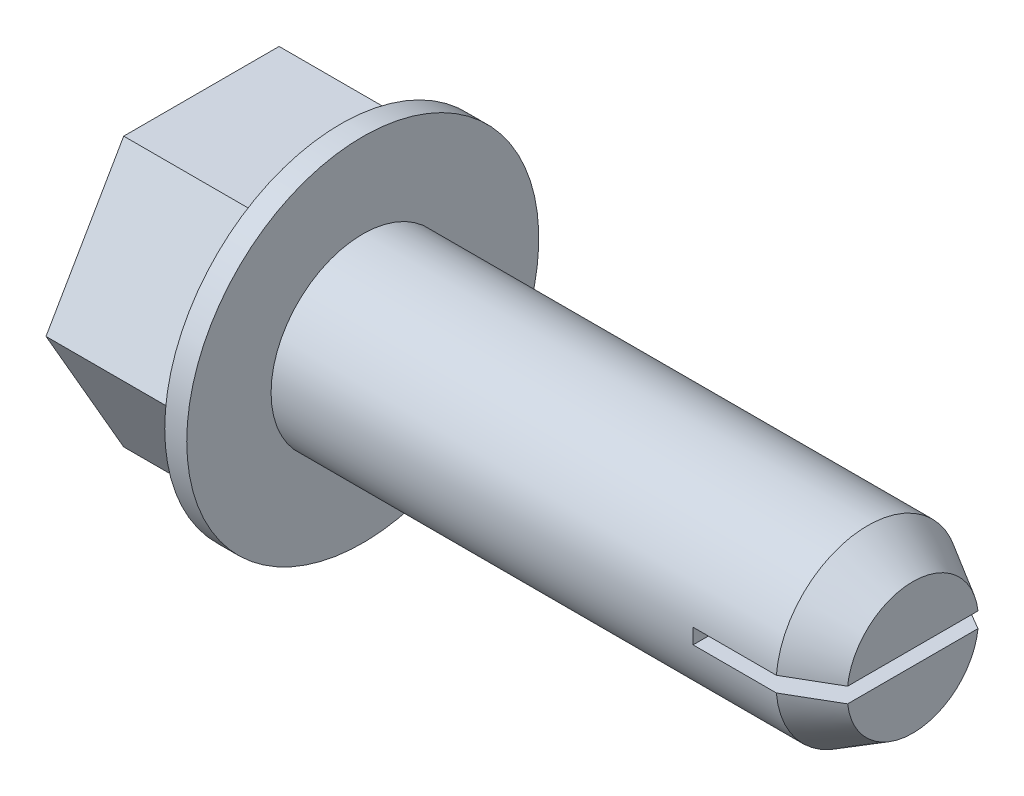
ISO-10303-21;
HEADER;
FILE_DESCRIPTION(('STEP AP214'),'2;1');
FILE_NAME('part.step','',(''),(''),'','','');
FILE_SCHEMA(('AUTOMOTIVE_DESIGN { 1 0 10303 214 1 1 1 1 }'));
ENDSEC;
DATA;
#1=APPLICATION_CONTEXT('core data for automotive mechanical design processes');
#2=APPLICATION_PROTOCOL_DEFINITION('international standard','automotive_design',2000,#1);
#3=PRODUCT_CONTEXT('',#1,'mechanical');
#4=PRODUCT('Part','Part','',(#3));
#5=PRODUCT_RELATED_PRODUCT_CATEGORY('part','',(#4));
#6=PRODUCT_DEFINITION_FORMATION('','',#4);
#7=PRODUCT_DEFINITION_CONTEXT('part definition',#1,'design');
#8=PRODUCT_DEFINITION('design','',#6,#7);
#9=PRODUCT_DEFINITION_SHAPE('','',#8);
#10=(LENGTH_UNIT() NAMED_UNIT(*) SI_UNIT(.MILLI.,.METRE.));
#11=(NAMED_UNIT(*) PLANE_ANGLE_UNIT() SI_UNIT($,.RADIAN.));
#12=(NAMED_UNIT(*) SI_UNIT($,.STERADIAN.) SOLID_ANGLE_UNIT());
#13=UNCERTAINTY_MEASURE_WITH_UNIT(LENGTH_MEASURE(1.E-05),#10,'distance_accuracy_value','');
#14=(GEOMETRIC_REPRESENTATION_CONTEXT(3) GLOBAL_UNCERTAINTY_ASSIGNED_CONTEXT((#13)) GLOBAL_UNIT_ASSIGNED_CONTEXT((#10,
#11,#12)) REPRESENTATION_CONTEXT('',''));
#15=CARTESIAN_POINT('',(0.,0.,0.));
#16=DIRECTION('',(0.,0.,1.));
#17=DIRECTION('',(1.,0.,0.));
#18=AXIS2_PLACEMENT_3D('',#15,#16,#17);
#19=CARTESIAN_POINT('',(-4.6228,3.72872,0.));
#20=DIRECTION('',(1.,0.,0.));
#21=DIRECTION('',(0.,0.,-1.));
#22=AXIS2_PLACEMENT_3D('',#19,#20,#21);
#23=PLANE('',#22);
#24=CARTESIAN_POINT('',(-4.6228,0.,0.));
#25=DIRECTION('',(-1.,0.,0.));
#26=DIRECTION('',(0.,0.,1.));
#27=AXIS2_PLACEMENT_3D('',#24,#25,#26);
#28=CIRCLE('',#27,3.72872);
#29=CARTESIAN_POINT('',(-4.6228,0.,3.72872));
#30=VERTEX_POINT('',#29);
#31=EDGE_CURVE('E21',#30,#30,#28,.T.);
#32=ORIENTED_EDGE('',*,*,#31,.T.);
#33=EDGE_LOOP('',(#32));
#34=FACE_BOUND('',#33,.T.);
#35=ADVANCED_FACE('F18',(#34),#23,.F.);
#36=CARTESIAN_POINT('',(0.,0.,0.));
#37=DIRECTION('',(-1.,0.,0.));
#38=DIRECTION('',(0.,0.,1.));
#39=AXIS2_PLACEMENT_3D('',#36,#37,#38);
#40=CYLINDRICAL_SURFACE('',#39,3.72872);
#41=ORIENTED_EDGE('',*,*,#31,.F.);
#42=EDGE_LOOP('',(#41));
#43=FACE_BOUND('',#42,.T.);
#44=CARTESIAN_POINT('',(-5.588,0.,0.));
#45=DIRECTION('',(-1.,0.,0.));
#46=DIRECTION('',(0.,0.,1.));
#47=AXIS2_PLACEMENT_3D('',#44,#45,#46);
#48=CIRCLE('',#47,3.72872);
#49=CARTESIAN_POINT('',(-5.588,0.,3.72872));
#50=VERTEX_POINT('',#49);
#51=EDGE_CURVE('E126',#50,#50,#48,.T.);
#52=ORIENTED_EDGE('',*,*,#51,.T.);
#53=EDGE_LOOP('',(#52));
#54=FACE_BOUND('',#53,.T.);
#55=ADVANCED_FACE('F213',(#43,#54),#40,.F.);
#56=CARTESIAN_POINT('',(-5.588,4.6609,0.));
#57=DIRECTION('',(1.,0.,0.));
#58=DIRECTION('',(0.,0.,-1.));
#59=AXIS2_PLACEMENT_3D('',#56,#57,#58);
#60=PLANE('',#59);
#61=DIRECTION('',(0.,0.,-1.));
#62=VECTOR('',#61,1.);
#63=CARTESIAN_POINT('',(-5.58799999998882,-4.6609,0.));
#64=LINE('',#63,#62);
#65=CARTESIAN_POINT('',(-5.58800000007968,-4.6609,2.69097186966593));
#66=VERTEX_POINT('',#65);
#67=CARTESIAN_POINT('',(-5.58799999999441,-4.6609,-2.69097186966593));
#68=VERTEX_POINT('',#67);
#69=EDGE_CURVE('E123',#66,#68,#64,.T.);
#70=ORIENTED_EDGE('',*,*,#69,.F.);
#71=DIRECTION('',(0.,-0.866025403784439,-0.5));
#72=VECTOR('',#71,1.);
#73=CARTESIAN_POINT('',(-5.5880000002162,-10.7431892055105,-0.820639440424718));
#74=LINE('',#73,#72);
#75=CARTESIAN_POINT('',(-5.58800000007968,0.,5.38194373933185));
#76=VERTEX_POINT('',#75);
#77=EDGE_CURVE('E118',#76,#66,#74,.T.);
#78=ORIENTED_EDGE('',*,*,#77,.F.);
#79=DIRECTION('',(0.,-0.866025403784439,0.5));
#80=VECTOR('',#79,1.);
#81=CARTESIAN_POINT('',(-5.58799999998882,-6.08228920551051,8.8935550494225));
#82=LINE('',#81,#80);
#83=CARTESIAN_POINT('',(-5.58799999999441,4.6609,2.69097186966593));
#84=VERTEX_POINT('',#83);
#85=EDGE_CURVE('E115',#84,#76,#82,.T.);
#86=ORIENTED_EDGE('',*,*,#85,.F.);
#87=DIRECTION('',(0.,0.,1.));
#88=VECTOR('',#87,1.);
#89=CARTESIAN_POINT('',(-5.58799999998882,4.6609,0.));
#90=LINE('',#89,#88);
#91=CARTESIAN_POINT('',(-5.58800000007968,4.6609,-2.69097186966593));
#92=VERTEX_POINT('',#91);
#93=EDGE_CURVE('E135',#92,#84,#90,.T.);
#94=ORIENTED_EDGE('',*,*,#93,.F.);
#95=DIRECTION('',(0.,0.866025403784439,0.5));
#96=VECTOR('',#95,1.);
#97=CARTESIAN_POINT('',(-5.5880000002162,-6.08228920551051,-8.8935550494225));
#98=LINE('',#97,#96);
#99=CARTESIAN_POINT('',(-5.58800000016215,0.,-5.38194373933185));
#100=VERTEX_POINT('',#99);
#101=EDGE_CURVE('E281',#100,#92,#98,.T.);
#102=ORIENTED_EDGE('',*,*,#101,.F.);
#103=DIRECTION('',(0.,0.866025403784439,-0.5));
#104=VECTOR('',#103,1.);
#105=CARTESIAN_POINT('',(-5.58799999998882,-10.7431892055105,0.82063944042472));
#106=LINE('',#105,#104);
#107=EDGE_CURVE('E273',#68,#100,#106,.T.);
#108=ORIENTED_EDGE('',*,*,#107,.F.);
#109=EDGE_LOOP('',(#70,#78,#86,#94,#102,#108));
#110=FACE_BOUND('',#109,.T.);
#111=ORIENTED_EDGE('',*,*,#51,.F.);
#112=EDGE_LOOP('',(#111));
#113=FACE_BOUND('',#112,.T.);
#114=ADVANCED_FACE('F120',(#110,#113),#60,.F.);
#115=CARTESIAN_POINT('',(500000.,-10.7431892055105,-0.820639440424718));
#116=DIRECTION('',(0.,-0.5,0.866025403784439));
#117=DIRECTION('',(0.,-0.866025403784439,-0.5));
#118=AXIS2_PLACEMENT_3D('',#115,#116,#117);
#119=PLANE('',#118);
#120=DIRECTION('',(0.,0.866025403784439,0.5));
#121=VECTOR('',#120,1.);
#122=CARTESIAN_POINT('',(-0.762,-4.6609,2.69097186966593));
#123=LINE('',#122,#121);
#124=CARTESIAN_POINT('',(-0.762000000091873,-4.6609,2.69097186966593));
#125=VERTEX_POINT('',#124);
#126=CARTESIAN_POINT('',(-0.762000000177139,0.,5.38194373933185));
#127=VERTEX_POINT('',#126);
#128=EDGE_CURVE('E132',#125,#127,#123,.T.);
#129=ORIENTED_EDGE('',*,*,#128,.T.);
#130=DIRECTION('',(1.,0.,0.));
#131=VECTOR('',#130,1.);
#132=CARTESIAN_POINT('',(500000.,0.,5.38194373933185));
#133=LINE('',#132,#131);
#134=EDGE_CURVE('E129',#76,#127,#133,.T.);
#135=ORIENTED_EDGE('',*,*,#134,.F.);
#136=ORIENTED_EDGE('',*,*,#77,.T.);
#137=DIRECTION('',(1.,0.,0.));
#138=VECTOR('',#137,1.);
#139=CARTESIAN_POINT('',(500000.,-4.6609,2.69097186966593));
#140=LINE('',#139,#138);
#141=EDGE_CURVE('E268',#125,#66,#140,.F.);
#142=ORIENTED_EDGE('',*,*,#141,.F.);
#143=EDGE_LOOP('',(#129,#135,#136,#142));
#144=FACE_BOUND('',#143,.T.);
#145=ADVANCED_FACE('F130',(#144),#119,.T.);
#146=CARTESIAN_POINT('',(500000.,-6.08228920551051,8.8935550494225));
#147=DIRECTION('',(0.,0.5,0.866025403784439));
#148=DIRECTION('',(0.,-0.866025403784439,0.5));
#149=AXIS2_PLACEMENT_3D('',#146,#147,#148);
#150=PLANE('',#149);
#151=DIRECTION('',(0.,0.866025403784439,-0.5));
#152=VECTOR('',#151,1.);
#153=CARTESIAN_POINT('',(-0.762,0.,5.38194373933185));
#154=LINE('',#153,#152);
#155=CARTESIAN_POINT('',(-0.762000000006608,4.6609,2.69097186966593));
#156=VERTEX_POINT('',#155);
#157=EDGE_CURVE('E265',#127,#156,#154,.T.);
#158=ORIENTED_EDGE('',*,*,#157,.T.);
#159=DIRECTION('',(1.,0.,0.));
#160=VECTOR('',#159,1.);
#161=CARTESIAN_POINT('',(500000.,4.6609,2.69097186966592));
#162=LINE('',#161,#160);
#163=EDGE_CURVE('E139',#84,#156,#162,.T.);
#164=ORIENTED_EDGE('',*,*,#163,.F.);
#165=ORIENTED_EDGE('',*,*,#85,.T.);
#166=ORIENTED_EDGE('',*,*,#134,.T.);
#167=EDGE_LOOP('',(#158,#164,#165,#166));
#168=FACE_BOUND('',#167,.T.);
#169=ADVANCED_FACE('F137',(#168),#150,.T.);
#170=CARTESIAN_POINT('',(500000.,4.6609,0.));
#171=DIRECTION('',(0.,1.,0.));
#172=DIRECTION('',(0.,0.,1.));
#173=AXIS2_PLACEMENT_3D('',#170,#171,#172);
#174=PLANE('',#173);
#175=DIRECTION('',(0.,0.,-1.));
#176=VECTOR('',#175,1.);
#177=CARTESIAN_POINT('',(-0.762,4.6609,0.));
#178=LINE('',#177,#176);
#179=CARTESIAN_POINT('',(-0.762000000049241,4.6609,-2.69097186966592));
#180=VERTEX_POINT('',#179);
#181=EDGE_CURVE('E263',#156,#180,#178,.T.);
#182=ORIENTED_EDGE('',*,*,#181,.T.);
#183=DIRECTION('',(1.,0.,0.));
#184=VECTOR('',#183,1.);
#185=CARTESIAN_POINT('',(500000.,4.6609,-2.69097186966592));
#186=LINE('',#185,#184);
#187=EDGE_CURVE('E278',#92,#180,#186,.T.);
#188=ORIENTED_EDGE('',*,*,#187,.F.);
#189=ORIENTED_EDGE('',*,*,#93,.T.);
#190=ORIENTED_EDGE('',*,*,#163,.T.);
#191=EDGE_LOOP('',(#182,#188,#189,#190));
#192=FACE_BOUND('',#191,.T.);
#193=ADVANCED_FACE('F286',(#192),#174,.T.);
#194=CARTESIAN_POINT('',(500000.,-6.08228920551051,-8.8935550494225));
#195=DIRECTION('',(0.,0.5,-0.866025403784439));
#196=DIRECTION('',(0.,0.866025403784439,0.5));
#197=AXIS2_PLACEMENT_3D('',#194,#195,#196);
#198=PLANE('',#197);
#199=DIRECTION('',(0.,-0.866025403784439,-0.5));
#200=VECTOR('',#199,1.);
#201=CARTESIAN_POINT('',(-0.762,4.6609,-2.69097186966593));
#202=LINE('',#201,#200);
#203=CARTESIAN_POINT('',(-0.762000000148717,0.,-5.38194373933185));
#204=VERTEX_POINT('',#203);
#205=EDGE_CURVE('E261',#180,#204,#202,.T.);
#206=ORIENTED_EDGE('',*,*,#205,.T.);
#207=DIRECTION('',(1.,0.,0.));
#208=VECTOR('',#207,1.);
#209=CARTESIAN_POINT('',(500000.,0.,-5.38194373933185));
#210=LINE('',#209,#208);
#211=EDGE_CURVE('E276',#100,#204,#210,.T.);
#212=ORIENTED_EDGE('',*,*,#211,.F.);
#213=ORIENTED_EDGE('',*,*,#101,.T.);
#214=ORIENTED_EDGE('',*,*,#187,.T.);
#215=EDGE_LOOP('',(#206,#212,#213,#214));
#216=FACE_BOUND('',#215,.T.);
#217=ADVANCED_FACE('F290',(#216),#198,.T.);
#218=CARTESIAN_POINT('',(500000.,-10.7431892055105,0.82063944042472));
#219=DIRECTION('',(0.,-0.5,-0.866025403784439));
#220=DIRECTION('',(0.,0.866025403784439,-0.5));
#221=AXIS2_PLACEMENT_3D('',#218,#219,#220);
#222=PLANE('',#221);
#223=DIRECTION('',(1.,0.,0.));
#224=VECTOR('',#223,1.);
#225=CARTESIAN_POINT('',(500000.,-4.6609,-2.69097186966593));
#226=LINE('',#225,#224);
#227=CARTESIAN_POINT('',(-0.761999999949765,-4.6609,-2.69097186966593));
#228=VERTEX_POINT('',#227);
#229=EDGE_CURVE('E270',#68,#228,#226,.T.);
#230=ORIENTED_EDGE('',*,*,#229,.F.);
#231=ORIENTED_EDGE('',*,*,#107,.T.);
#232=ORIENTED_EDGE('',*,*,#211,.T.);
#233=DIRECTION('',(0.,-0.866025403784439,0.499999999999999));
#234=VECTOR('',#233,1.);
#235=CARTESIAN_POINT('',(-0.762,0.,-5.38194373933185));
#236=LINE('',#235,#234);
#237=EDGE_CURVE('E82',#204,#228,#236,.T.);
#238=ORIENTED_EDGE('',*,*,#237,.T.);
#239=EDGE_LOOP('',(#230,#231,#232,#238));
#240=FACE_BOUND('',#239,.T.);
#241=ADVANCED_FACE('F292',(#240),#222,.T.);
#242=CARTESIAN_POINT('',(500000.,-4.6609,0.));
#243=DIRECTION('',(0.,-1.,0.));
#244=DIRECTION('',(0.,0.,-1.));
#245=AXIS2_PLACEMENT_3D('',#242,#243,#244);
#246=PLANE('',#245);
#247=DIRECTION('',(0.,0.,-1.));
#248=VECTOR('',#247,1.);
#249=CARTESIAN_POINT('',(-0.762,-4.6609,0.));
#250=LINE('',#249,#248);
#251=EDGE_CURVE('E205',#228,#125,#250,.F.);
#252=ORIENTED_EDGE('',*,*,#251,.T.);
#253=ORIENTED_EDGE('',*,*,#141,.T.);
#254=ORIENTED_EDGE('',*,*,#69,.T.);
#255=ORIENTED_EDGE('',*,*,#229,.T.);
#256=EDGE_LOOP('',(#252,#253,#254,#255));
#257=FACE_BOUND('',#256,.T.);
#258=ADVANCED_FACE('F295',(#257),#246,.T.);
#259=CARTESIAN_POINT('',(-0.762,6.096,0.));
#260=DIRECTION('',(1.,0.,0.));
#261=DIRECTION('',(0.,0.,-1.));
#262=AXIS2_PLACEMENT_3D('',#259,#260,#261);
#263=PLANE('',#262);
#264=CARTESIAN_POINT('',(-0.762,0.,0.));
#265=DIRECTION('',(-1.,0.,0.));
#266=DIRECTION('',(0.,0.,1.));
#267=AXIS2_PLACEMENT_3D('',#264,#265,#266);
#268=CIRCLE('',#267,6.096);
#269=CARTESIAN_POINT('',(-0.762,0.,6.096));
#270=VERTEX_POINT('',#269);
#271=EDGE_CURVE('E203',#270,#270,#268,.F.);
#272=ORIENTED_EDGE('',*,*,#271,.F.);
#273=EDGE_LOOP('',(#272));
#274=FACE_BOUND('',#273,.T.);
#275=ORIENTED_EDGE('',*,*,#237,.F.);
#276=ORIENTED_EDGE('',*,*,#205,.F.);
#277=ORIENTED_EDGE('',*,*,#181,.F.);
#278=ORIENTED_EDGE('',*,*,#157,.F.);
#279=ORIENTED_EDGE('',*,*,#128,.F.);
#280=ORIENTED_EDGE('',*,*,#251,.F.);
#281=EDGE_LOOP('',(#275,#276,#277,#278,#279,#280));
#282=FACE_BOUND('',#281,.T.);
#283=ADVANCED_FACE('F297',(#274,#282),#263,.F.);
#284=CARTESIAN_POINT('',(19.05,3.175,0.));
#285=DIRECTION('',(-1.,0.,0.));
#286=DIRECTION('',(0.,0.,1.));
#287=AXIS2_PLACEMENT_3D('',#284,#285,#286);
#288=PLANE('',#287);
#289=DIRECTION('',(0.,0.,-1.));
#290=VECTOR('',#289,1.);
#291=CARTESIAN_POINT('',(19.05,-0.264583333333333,-6.096));
#292=LINE('',#291,#290);
#293=CARTESIAN_POINT('',(19.0500000000004,-0.264583333333333,-2.25785042680903));
#294=VERTEX_POINT('',#293);
#295=CARTESIAN_POINT('',(19.0499999999965,-0.264583333333333,2.25785042681133));
#296=VERTEX_POINT('',#295);
#297=EDGE_CURVE('E201',#294,#296,#292,.F.);
#298=ORIENTED_EDGE('',*,*,#297,.T.);
#299=CARTESIAN_POINT('',(19.0499999999929,0.,0.));
#300=DIRECTION('',(-1.,0.,0.));
#301=DIRECTION('',(0.,0.,1.));
#302=AXIS2_PLACEMENT_3D('',#299,#300,#301);
#303=CIRCLE('',#302,2.27330000003061);
#304=EDGE_CURVE('E73',#294,#296,#303,.T.);
#305=ORIENTED_EDGE('',*,*,#304,.F.);
#306=EDGE_LOOP('',(#298,#305));
#307=FACE_BOUND('',#306,.T.);
#308=ADVANCED_FACE('F299',(#307),#288,.F.);
#309=CARTESIAN_POINT('',(0.,0.,0.));
#310=DIRECTION('',(-1.,0.,0.));
#311=DIRECTION('',(0.,0.,1.));
#312=AXIS2_PLACEMENT_3D('',#309,#310,#311);
#313=CYLINDRICAL_SURFACE('',#312,6.096);
#314=ORIENTED_EDGE('',*,*,#271,.T.);
#315=EDGE_LOOP('',(#314));
#316=FACE_BOUND('',#315,.T.);
#317=CARTESIAN_POINT('',(0.,0.,0.));
#318=DIRECTION('',(-1.,0.,0.));
#319=DIRECTION('',(0.,0.,1.));
#320=AXIS2_PLACEMENT_3D('',#317,#318,#319);
#321=CIRCLE('',#320,6.096);
#322=CARTESIAN_POINT('',(0.,0.,6.096));
#323=VERTEX_POINT('',#322);
#324=EDGE_CURVE('E241',#323,#323,#321,.T.);
#325=ORIENTED_EDGE('',*,*,#324,.T.);
#326=EDGE_LOOP('',(#325));
#327=FACE_BOUND('',#326,.T.);
#328=ADVANCED_FACE('F306',(#316,#327),#313,.T.);
#329=CARTESIAN_POINT('',(17.488209787075,0.,0.));
#330=DIRECTION('',(-1.,0.,0.));
#331=DIRECTION('',(0.,0.,1.));
#332=AXIS2_PLACEMENT_3D('',#329,#330,#331);
#333=CONICAL_SURFACE('',#332,3.17499999988513,0.523598775602448);
#334=CARTESIAN_POINT('',(17.4882097868304,-0.264583333333333,-3.16395648830533));
#335=CARTESIAN_POINT('',(17.7485950521458,-0.264583333333333,-3.01308870934584));
#336=CARTESIAN_POINT('',(18.0089562455111,-0.264583333333333,-2.86217927282826));
#337=CARTESIAN_POINT('',(18.3994183217583,-0.264583333333333,-2.63567773139847));
#338=CARTESIAN_POINT('',(18.5295590617472,-0.264583333333333,-2.56015431969282));
#339=CARTESIAN_POINT('',(18.7898067189707,-0.264583333333333,-2.40904920796175));
#340=CARTESIAN_POINT('',(18.9199136362009,-0.264583333333333,-2.333467507929));
#341=CARTESIAN_POINT('',(19.0500000000079,-0.264583333333333,-2.25785042680467));
#342=B_SPLINE_CURVE_WITH_KNOTS('',3,(#334,#335,#336,#337,#338,#339,#340,#341),.UNSPECIFIED.,.F.,
.F.,(4,2,2,4),(0.,0.902803568709945,1.35420535449983,1.80560719706211),.UNSPECIFIED.);
#343=CARTESIAN_POINT('',(17.4882097868228,-0.264583333333333,-3.16395648829212));
#344=VERTEX_POINT('',#343);
#345=EDGE_CURVE('E196',#344,#294,#342,.T.);
#346=ORIENTED_EDGE('',*,*,#345,.T.);
#347=ORIENTED_EDGE('',*,*,#304,.T.);
#348=CARTESIAN_POINT('',(19.0500000000073,-0.264583333333333,2.257850426805));
#349=CARTESIAN_POINT('',(18.9199136362004,-0.264583333333333,2.3334675079293));
#350=CARTESIAN_POINT('',(18.7898067189702,-0.264583333333333,2.40904920796202));
#351=CARTESIAN_POINT('',(18.5295590617469,-0.264583333333333,2.56015431969304));
#352=CARTESIAN_POINT('',(18.3994183217579,-0.264583333333333,2.63567773139866));
#353=CARTESIAN_POINT('',(18.0089562455109,-0.264583333333333,2.86217927282837));
#354=CARTESIAN_POINT('',(17.7485950521457,-0.264583333333333,3.01308870934589));
#355=CARTESIAN_POINT('',(17.4882097868304,-0.264583333333333,3.16395648830533));
#356=B_SPLINE_CURVE_WITH_KNOTS('',3,(#348,#349,#350,#351,#352,#353,#354,#355),.UNSPECIFIED.,.F.,
.F.,(4,2,2,4),(0.,0.451401842562117,0.902803628351839,1.80560719706146),.UNSPECIFIED.);
#357=CARTESIAN_POINT('',(17.4882097868228,-0.264583333333333,3.16395648829212));
#358=VERTEX_POINT('',#357);
#359=EDGE_CURVE('E190',#296,#358,#356,.T.);
#360=ORIENTED_EDGE('',*,*,#359,.T.);
#361=CARTESIAN_POINT('',(17.4882097868151,0.,0.));
#362=DIRECTION('',(-1.,0.,0.));
#363=DIRECTION('',(0.,0.,1.));
#364=AXIS2_PLACEMENT_3D('',#361,#362,#363);
#365=CIRCLE('',#364,3.175);
#366=EDGE_CURVE('E250',#344,#358,#365,.T.);
#367=ORIENTED_EDGE('',*,*,#366,.F.);
#368=EDGE_LOOP('',(#346,#347,#360,#367));
#369=FACE_BOUND('',#368,.T.);
#370=ADVANCED_FACE('F184',(#369),#333,.T.);
#371=CARTESIAN_POINT('',(14.605,-0.264583333333333,-6.096));
#372=DIRECTION('',(0.,-1.,0.));
#373=DIRECTION('',(0.,0.,-1.));
#374=AXIS2_PLACEMENT_3D('',#371,#372,#373);
#375=PLANE('',#374);
#376=ORIENTED_EDGE('',*,*,#297,.F.);
#377=ORIENTED_EDGE('',*,*,#345,.F.);
#378=DIRECTION('',(-1.,0.,0.));
#379=VECTOR('',#378,1.);
#380=CARTESIAN_POINT('',(0.,-0.264583333333333,-3.16395648827891));
#381=LINE('',#380,#379);
#382=CARTESIAN_POINT('',(14.605,-0.264583333333333,-3.16395648827891));
#383=VERTEX_POINT('',#382);
#384=EDGE_CURVE('E253',#383,#344,#381,.F.);
#385=ORIENTED_EDGE('',*,*,#384,.F.);
#386=DIRECTION('',(0.,0.,1.));
#387=VECTOR('',#386,1.);
#388=CARTESIAN_POINT('',(14.605,-0.264583333333333,-6.096));
#389=LINE('',#388,#387);
#390=CARTESIAN_POINT('',(14.605,-0.264583333333333,3.16395648827891));
#391=VERTEX_POINT('',#390);
#392=EDGE_CURVE('E239',#383,#391,#389,.T.);
#393=ORIENTED_EDGE('',*,*,#392,.T.);
#394=DIRECTION('',(-1.,0.,0.));
#395=VECTOR('',#394,1.);
#396=CARTESIAN_POINT('',(0.,-0.264583333333333,3.16395648827891));
#397=LINE('',#396,#395);
#398=EDGE_CURVE('E246',#358,#391,#397,.T.);
#399=ORIENTED_EDGE('',*,*,#398,.F.);
#400=ORIENTED_EDGE('',*,*,#359,.F.);
#401=EDGE_LOOP('',(#376,#377,#385,#393,#399,#400));
#402=FACE_BOUND('',#401,.T.);
#403=ADVANCED_FACE('F179',(#402),#375,.F.);
#404=CARTESIAN_POINT('',(14.605,0.264583333333333,-6.096));
#405=DIRECTION('',(-1.,0.,0.));
#406=DIRECTION('',(0.,0.,1.));
#407=AXIS2_PLACEMENT_3D('',#404,#405,#406);
#408=PLANE('',#407);
#409=DIRECTION('',(0.,0.,1.));
#410=VECTOR('',#409,1.);
#411=CARTESIAN_POINT('',(14.605,0.264583333333333,-6.096));
#412=LINE('',#411,#410);
#413=CARTESIAN_POINT('',(14.605,0.264583333333334,-3.16395648827891));
#414=VERTEX_POINT('',#413);
#415=CARTESIAN_POINT('',(14.605,0.264583333333333,3.16395648827891));
#416=VERTEX_POINT('',#415);
#417=EDGE_CURVE('E242',#414,#416,#412,.T.);
#418=ORIENTED_EDGE('',*,*,#417,.T.);
#419=CARTESIAN_POINT('',(14.605,0.,0.));
#420=DIRECTION('',(-1.,0.,0.));
#421=DIRECTION('',(0.,0.,1.));
#422=AXIS2_PLACEMENT_3D('',#419,#420,#421);
#423=CIRCLE('',#422,3.175);
#424=EDGE_CURVE('E249',#391,#416,#423,.T.);
#425=ORIENTED_EDGE('',*,*,#424,.F.);
#426=ORIENTED_EDGE('',*,*,#392,.F.);
#427=CARTESIAN_POINT('',(14.605,0.,0.));
#428=DIRECTION('',(-1.,0.,0.));
#429=DIRECTION('',(0.,0.,1.));
#430=AXIS2_PLACEMENT_3D('',#427,#428,#429);
#431=CIRCLE('',#430,3.175);
#432=EDGE_CURVE('E256',#414,#383,#431,.T.);
#433=ORIENTED_EDGE('',*,*,#432,.F.);
#434=EDGE_LOOP('',(#418,#425,#426,#433));
#435=FACE_BOUND('',#434,.T.);
#436=ADVANCED_FACE('F175',(#435),#408,.F.);
#437=CARTESIAN_POINT('',(19.05,3.175,0.));
#438=DIRECTION('',(-1.,0.,0.));
#439=DIRECTION('',(0.,0.,1.));
#440=AXIS2_PLACEMENT_3D('',#437,#438,#439);
#441=PLANE('',#440);
#442=DIRECTION('',(0.,0.,1.));
#443=VECTOR('',#442,1.);
#444=CARTESIAN_POINT('',(19.05,0.264583333333333,-6.096));
#445=LINE('',#444,#443);
#446=CARTESIAN_POINT('',(19.0500000000004,0.264583333333333,2.25785042680903));
#447=VERTEX_POINT('',#446);
#448=CARTESIAN_POINT('',(19.0499999999965,0.264583333333333,-2.25785042681133));
#449=VERTEX_POINT('',#448);
#450=EDGE_CURVE('E154',#447,#449,#445,.F.);
#451=ORIENTED_EDGE('',*,*,#450,.T.);
#452=CARTESIAN_POINT('',(19.0499999999929,0.,0.));
#453=DIRECTION('',(-1.,0.,0.));
#454=DIRECTION('',(0.,0.,1.));
#455=AXIS2_PLACEMENT_3D('',#452,#453,#454);
#456=CIRCLE('',#455,2.27330000003061);
#457=EDGE_CURVE('E245',#447,#449,#456,.T.);
#458=ORIENTED_EDGE('',*,*,#457,.F.);
#459=EDGE_LOOP('',(#451,#458));
#460=FACE_BOUND('',#459,.T.);
#461=ADVANCED_FACE('F171',(#460),#441,.F.);
#462=CARTESIAN_POINT('',(0.,3.175,0.));
#463=DIRECTION('',(-1.,0.,0.));
#464=DIRECTION('',(0.,0.,1.));
#465=AXIS2_PLACEMENT_3D('',#462,#463,#464);
#466=PLANE('',#465);
#467=CARTESIAN_POINT('',(0.,0.,0.));
#468=DIRECTION('',(-1.,0.,0.));
#469=DIRECTION('',(0.,0.,1.));
#470=AXIS2_PLACEMENT_3D('',#467,#468,#469);
#471=CIRCLE('',#470,3.175);
#472=CARTESIAN_POINT('',(0.,0.,3.175));
#473=VERTEX_POINT('',#472);
#474=EDGE_CURVE('E144',#473,#473,#471,.F.);
#475=ORIENTED_EDGE('',*,*,#474,.F.);
#476=EDGE_LOOP('',(#475));
#477=FACE_BOUND('',#476,.T.);
#478=ORIENTED_EDGE('',*,*,#324,.F.);
#479=EDGE_LOOP('',(#478));
#480=FACE_BOUND('',#479,.T.);
#481=ADVANCED_FACE('F167',(#477,#480),#466,.F.);
#482=CARTESIAN_POINT('',(17.488209787075,0.,0.));
#483=DIRECTION('',(-1.,0.,0.));
#484=DIRECTION('',(0.,0.,1.));
#485=AXIS2_PLACEMENT_3D('',#482,#483,#484);
#486=CONICAL_SURFACE('',#485,3.17499999988513,0.523598775602448);
#487=CARTESIAN_POINT('',(17.4882097868351,0.264583333333333,3.16395648830265));
#488=CARTESIAN_POINT('',(17.7485950521496,0.264583333333333,3.0130887093436));
#489=CARTESIAN_POINT('',(18.0089562455142,0.264583333333333,2.86217927282647));
#490=CARTESIAN_POINT('',(18.3994183217602,0.264583333333333,2.63567773139735));
#491=CARTESIAN_POINT('',(18.5295590617488,0.264583333333333,2.56015431969193));
#492=CARTESIAN_POINT('',(18.7898067189715,0.264583333333333,2.40904920796131));
#493=CARTESIAN_POINT('',(18.9199136362013,0.264583333333333,2.33346750792877));
#494=CARTESIAN_POINT('',(19.0500000000079,0.264583333333333,2.25785042680467));
#495=B_SPLINE_CURVE_WITH_KNOTS('',3,(#487,#488,#489,#490,#491,#492,#493,#494),.UNSPECIFIED.,.F.,
.F.,(4,2,2,4),(0.,0.902803568707271,1.35420535449581,1.80560719705676),.UNSPECIFIED.);
#496=CARTESIAN_POINT('',(17.4882097868251,0.264583333333333,3.16395648829078));
#497=VERTEX_POINT('',#496);
#498=EDGE_CURVE('E155',#497,#447,#495,.T.);
#499=ORIENTED_EDGE('',*,*,#498,.T.);
#500=ORIENTED_EDGE('',*,*,#457,.T.);
#501=CARTESIAN_POINT('',(19.0500000000051,0.264583333333333,-2.25785042680627));
#502=CARTESIAN_POINT('',(18.9199136361991,0.264583333333333,-2.33346750793001));
#503=CARTESIAN_POINT('',(18.7898067189699,0.264583333333333,-2.40904920796219));
#504=CARTESIAN_POINT('',(18.5295590617485,0.264583333333333,-2.5601543196921));
#505=CARTESIAN_POINT('',(18.3994183217605,0.264583333333333,-2.63567773139716));
#506=CARTESIAN_POINT('',(18.0089562455164,0.264583333333333,-2.86217927282522));
#507=CARTESIAN_POINT('',(17.748595052153,0.264583333333333,-3.01308870934164));
#508=CARTESIAN_POINT('',(17.4882097868397,0.264583333333333,-3.16395648829997));
#509=B_SPLINE_CURVE_WITH_KNOTS('',3,(#501,#502,#503,#504,#505,#506,#507,#508),.UNSPECIFIED.,.F.,
.F.,(4,2,2,4),(0.,0.451401842558815,0.902803628345232,1.80560719704824),.UNSPECIFIED.);
#510=CARTESIAN_POINT('',(17.4882097868274,0.264583333333334,-3.16395648828944));
#511=VERTEX_POINT('',#510);
#512=EDGE_CURVE('E36',#449,#511,#509,.T.);
#513=ORIENTED_EDGE('',*,*,#512,.T.);
#514=CARTESIAN_POINT('',(17.4882097868151,0.,0.));
#515=DIRECTION('',(-1.,0.,0.));
#516=DIRECTION('',(0.,0.,1.));
#517=AXIS2_PLACEMENT_3D('',#514,#515,#516);
#518=CIRCLE('',#517,3.175);
#519=EDGE_CURVE('E27',#497,#511,#518,.T.);
#520=ORIENTED_EDGE('',*,*,#519,.F.);
#521=EDGE_LOOP('',(#499,#500,#513,#520));
#522=FACE_BOUND('',#521,.T.);
#523=ADVANCED_FACE('F163',(#522),#486,.T.);
#524=CARTESIAN_POINT('',(14.605,0.264583333333333,-6.096));
#525=DIRECTION('',(0.,1.,0.));
#526=DIRECTION('',(0.,0.,1.));
#527=AXIS2_PLACEMENT_3D('',#524,#525,#526);
#528=PLANE('',#527);
#529=ORIENTED_EDGE('',*,*,#450,.F.);
#530=ORIENTED_EDGE('',*,*,#498,.F.);
#531=DIRECTION('',(-1.,0.,0.));
#532=VECTOR('',#531,1.);
#533=CARTESIAN_POINT('',(0.,0.264583333333334,3.16395648827891));
#534=LINE('',#533,#532);
#535=EDGE_CURVE('E147',#416,#497,#534,.F.);
#536=ORIENTED_EDGE('',*,*,#535,.F.);
#537=ORIENTED_EDGE('',*,*,#417,.F.);
#538=DIRECTION('',(-1.,0.,0.));
#539=VECTOR('',#538,1.);
#540=CARTESIAN_POINT('',(0.,0.264583333333334,-3.16395648827891));
#541=LINE('',#540,#539);
#542=EDGE_CURVE('E11',#511,#414,#541,.T.);
#543=ORIENTED_EDGE('',*,*,#542,.F.);
#544=ORIENTED_EDGE('',*,*,#512,.F.);
#545=EDGE_LOOP('',(#529,#530,#536,#537,#543,#544));
#546=FACE_BOUND('',#545,.T.);
#547=ADVANCED_FACE('F160',(#546),#528,.F.);
#548=CARTESIAN_POINT('',(0.,0.,0.));
#549=DIRECTION('',(-1.,0.,0.));
#550=DIRECTION('',(0.,0.,1.));
#551=AXIS2_PLACEMENT_3D('',#548,#549,#550);
#552=CYLINDRICAL_SURFACE('',#551,3.175);
#553=ORIENTED_EDGE('',*,*,#474,.T.);
#554=EDGE_LOOP('',(#553));
#555=FACE_BOUND('',#554,.T.);
#556=ORIENTED_EDGE('',*,*,#519,.T.);
#557=ORIENTED_EDGE('',*,*,#542,.T.);
#558=ORIENTED_EDGE('',*,*,#432,.T.);
#559=ORIENTED_EDGE('',*,*,#384,.T.);
#560=ORIENTED_EDGE('',*,*,#366,.T.);
#561=ORIENTED_EDGE('',*,*,#398,.T.);
#562=ORIENTED_EDGE('',*,*,#424,.T.);
#563=ORIENTED_EDGE('',*,*,#535,.T.);
#564=EDGE_LOOP('',(#556,#557,#558,#559,#560,#561,#562,#563));
#565=FACE_BOUND('',#564,.T.);
#566=ADVANCED_FACE('F221',(#555,#565),#552,.T.);
#567=CLOSED_SHELL('',(#35,#55,#114,#145,#169,#193,#217,#241,#258,#283,#308,#328,#370,#403,#436,
#461,#481,#523,#547,#566));
#568=MANIFOLD_SOLID_BREP('B1',#567);
#569=ADVANCED_BREP_SHAPE_REPRESENTATION('',(#18,#568),#14);
#570=SHAPE_DEFINITION_REPRESENTATION(#9,#569);
ENDSEC;
END-ISO-10303-21;
